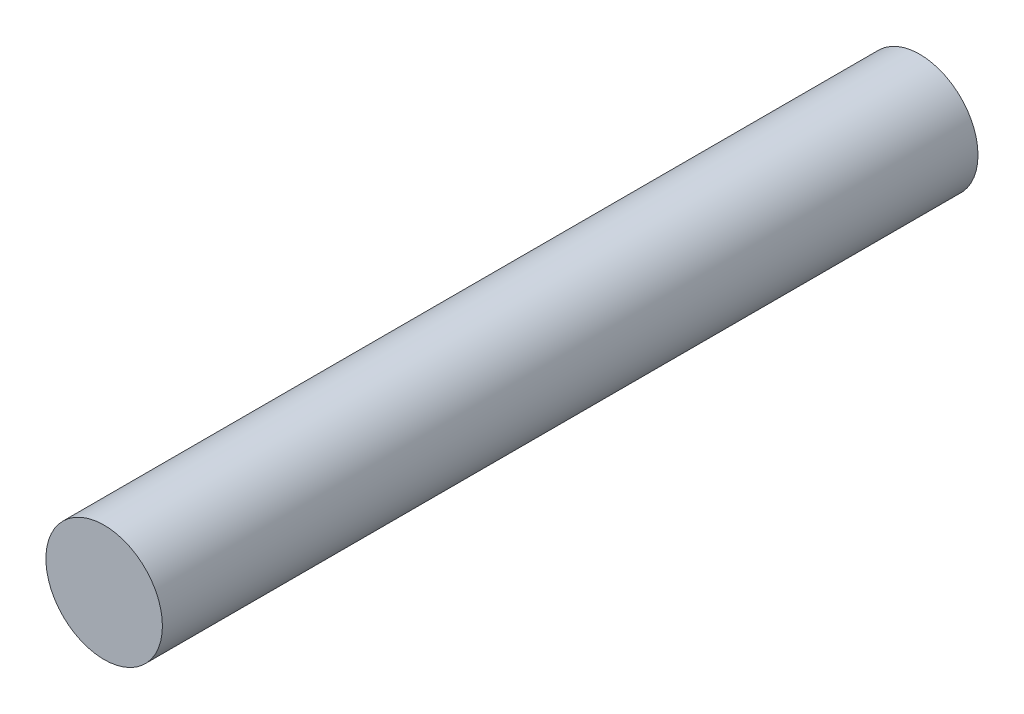
ISO-10303-21;
HEADER;
FILE_DESCRIPTION(('STEP AP214'),'2;1');
FILE_NAME('part.step','',(''),(''),'','','');
FILE_SCHEMA(('AUTOMOTIVE_DESIGN { 1 0 10303 214 1 1 1 1 }'));
ENDSEC;
DATA;
#1=APPLICATION_CONTEXT('core data for automotive mechanical design processes');
#2=APPLICATION_PROTOCOL_DEFINITION('international standard','automotive_design',2000,#1);
#3=PRODUCT_CONTEXT('',#1,'mechanical');
#4=PRODUCT('Part','Part','',(#3));
#5=PRODUCT_RELATED_PRODUCT_CATEGORY('part','',(#4));
#6=PRODUCT_DEFINITION_FORMATION('','',#4);
#7=PRODUCT_DEFINITION_CONTEXT('part definition',#1,'design');
#8=PRODUCT_DEFINITION('design','',#6,#7);
#9=PRODUCT_DEFINITION_SHAPE('','',#8);
#10=(LENGTH_UNIT() NAMED_UNIT(*) SI_UNIT(.MILLI.,.METRE.));
#11=(NAMED_UNIT(*) PLANE_ANGLE_UNIT() SI_UNIT($,.RADIAN.));
#12=(NAMED_UNIT(*) SI_UNIT($,.STERADIAN.) SOLID_ANGLE_UNIT());
#13=UNCERTAINTY_MEASURE_WITH_UNIT(LENGTH_MEASURE(1.E-05),#10,'distance_accuracy_value','');
#14=(GEOMETRIC_REPRESENTATION_CONTEXT(3) GLOBAL_UNCERTAINTY_ASSIGNED_CONTEXT((#13)) GLOBAL_UNIT_ASSIGNED_CONTEXT((#10,
#11,#12)) REPRESENTATION_CONTEXT('',''));
#15=CARTESIAN_POINT('',(0.,0.,0.));
#16=DIRECTION('',(0.,0.,1.));
#17=DIRECTION('',(1.,0.,0.));
#18=AXIS2_PLACEMENT_3D('',#15,#16,#17);
#19=CARTESIAN_POINT('',(0.,0.,7.));
#20=DIRECTION('',(0.,0.,-1.));
#21=DIRECTION('',(-1.,0.,0.));
#22=AXIS2_PLACEMENT_3D('',#19,#20,#21);
#23=CYLINDRICAL_SURFACE('',#22,1.);
#24=CARTESIAN_POINT('',(0.,0.,7.));
#25=DIRECTION('',(0.,0.,1.));
#26=DIRECTION('',(1.,0.,0.));
#27=AXIS2_PLACEMENT_3D('',#24,#25,#26);
#28=CIRCLE('',#27,1.);
#29=CARTESIAN_POINT('',(1.,0.,7.));
#30=VERTEX_POINT('',#29);
#31=EDGE_CURVE('E10',#30,#30,#28,.T.);
#32=ORIENTED_EDGE('',*,*,#31,.F.);
#33=EDGE_LOOP('',(#32));
#34=FACE_BOUND('',#33,.T.);
#35=CARTESIAN_POINT('',(0.,0.,-7.));
#36=DIRECTION('',(0.,0.,1.));
#37=DIRECTION('',(1.,0.,0.));
#38=AXIS2_PLACEMENT_3D('',#35,#36,#37);
#39=CIRCLE('',#38,1.);
#40=CARTESIAN_POINT('',(1.,0.,-7.));
#41=VERTEX_POINT('',#40);
#42=EDGE_CURVE('E40',#41,#41,#39,.T.);
#43=ORIENTED_EDGE('',*,*,#42,.T.);
#44=EDGE_LOOP('',(#43));
#45=FACE_BOUND('',#44,.T.);
#46=ADVANCED_FACE('F37',(#34,#45),#23,.T.);
#47=CARTESIAN_POINT('',(0.,0.,7.));
#48=DIRECTION('',(0.,0.,1.));
#49=DIRECTION('',(1.,0.,0.));
#50=AXIS2_PLACEMENT_3D('',#47,#48,#49);
#51=PLANE('',#50);
#52=ORIENTED_EDGE('',*,*,#31,.T.);
#53=EDGE_LOOP('',(#52));
#54=FACE_BOUND('',#53,.T.);
#55=ADVANCED_FACE('F54',(#54),#51,.T.);
#56=CARTESIAN_POINT('',(0.,0.,-7.));
#57=DIRECTION('',(0.,0.,1.));
#58=DIRECTION('',(1.,0.,0.));
#59=AXIS2_PLACEMENT_3D('',#56,#57,#58);
#60=PLANE('',#59);
#61=ORIENTED_EDGE('',*,*,#42,.F.);
#62=EDGE_LOOP('',(#61));
#63=FACE_BOUND('',#62,.T.);
#64=ADVANCED_FACE('F52',(#63),#60,.F.);
#65=CLOSED_SHELL('',(#46,#55,#64));
#66=MANIFOLD_SOLID_BREP('B2',#65);
#67=ADVANCED_BREP_SHAPE_REPRESENTATION('',(#18,#66),#14);
#68=SHAPE_DEFINITION_REPRESENTATION(#9,#67);
ENDSEC;
END-ISO-10303-21;
